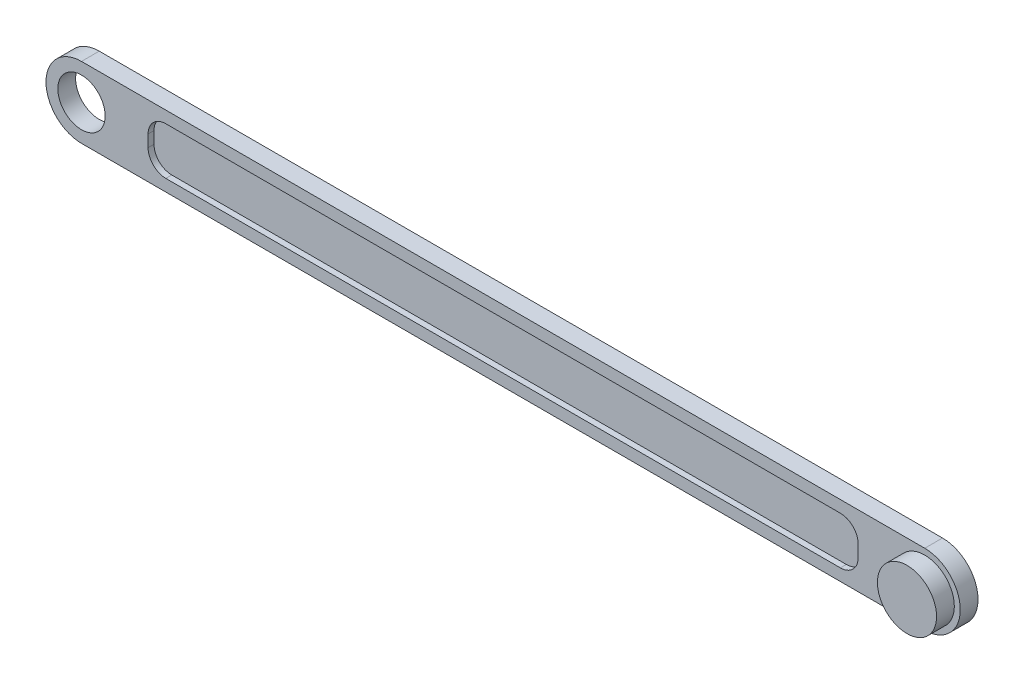
ISO-10303-21;
HEADER;
FILE_DESCRIPTION(('STEP AP214'),'2;1');
FILE_NAME('part.step','',(''),(''),'','','');
FILE_SCHEMA(('AUTOMOTIVE_DESIGN { 1 0 10303 214 1 1 1 1 }'));
ENDSEC;
DATA;
#1=APPLICATION_CONTEXT('core data for automotive mechanical design processes');
#2=APPLICATION_PROTOCOL_DEFINITION('international standard','automotive_design',2000,#1);
#3=PRODUCT_CONTEXT('',#1,'mechanical');
#4=PRODUCT('Part','Part','',(#3));
#5=PRODUCT_RELATED_PRODUCT_CATEGORY('part','',(#4));
#6=PRODUCT_DEFINITION_FORMATION('','',#4);
#7=PRODUCT_DEFINITION_CONTEXT('part definition',#1,'design');
#8=PRODUCT_DEFINITION('design','',#6,#7);
#9=PRODUCT_DEFINITION_SHAPE('','',#8);
#10=(LENGTH_UNIT() NAMED_UNIT(*) SI_UNIT(.MILLI.,.METRE.));
#11=(NAMED_UNIT(*) PLANE_ANGLE_UNIT() SI_UNIT($,.RADIAN.));
#12=(NAMED_UNIT(*) SI_UNIT($,.STERADIAN.) SOLID_ANGLE_UNIT());
#13=UNCERTAINTY_MEASURE_WITH_UNIT(LENGTH_MEASURE(1.E-05),#10,'distance_accuracy_value','');
#14=(GEOMETRIC_REPRESENTATION_CONTEXT(3) GLOBAL_UNCERTAINTY_ASSIGNED_CONTEXT((#13)) GLOBAL_UNIT_ASSIGNED_CONTEXT((#10,
#11,#12)) REPRESENTATION_CONTEXT('',''));
#15=CARTESIAN_POINT('',(0.,0.,0.));
#16=DIRECTION('',(0.,0.,1.));
#17=DIRECTION('',(1.,0.,0.));
#18=AXIS2_PLACEMENT_3D('',#15,#16,#17);
#19=CARTESIAN_POINT('',(0.,0.,3.));
#20=DIRECTION('',(0.,0.,1.));
#21=DIRECTION('',(1.,0.,0.));
#22=AXIS2_PLACEMENT_3D('',#19,#20,#21);
#23=PLANE('',#22);
#24=DIRECTION('',(0.,1.,0.));
#25=VECTOR('',#24,1.);
#26=CARTESIAN_POINT('',(131.25,-4.00000000000002,3.));
#27=LINE('',#26,#25);
#28=CARTESIAN_POINT('',(131.25,-1.00000000000001,3.));
#29=VERTEX_POINT('',#28);
#30=CARTESIAN_POINT('',(131.25,1.00000000000002,3.));
#31=VERTEX_POINT('',#30);
#32=EDGE_CURVE('E203',#29,#31,#27,.T.);
#33=ORIENTED_EDGE('',*,*,#32,.F.);
#34=CARTESIAN_POINT('',(128.25,-1.00000000000001,3.));
#35=DIRECTION('',(0.,0.,1.));
#36=DIRECTION('',(1.,0.,0.));
#37=AXIS2_PLACEMENT_3D('',#34,#35,#36);
#38=CIRCLE('',#37,3.);
#39=CARTESIAN_POINT('',(128.25,-4.00000000000002,3.));
#40=VERTEX_POINT('',#39);
#41=EDGE_CURVE('E189',#29,#40,#38,.F.);
#42=ORIENTED_EDGE('',*,*,#41,.T.);
#43=DIRECTION('',(1.,0.,0.));
#44=VECTOR('',#43,1.);
#45=CARTESIAN_POINT('',(11.25,-4.00000000000002,3.));
#46=LINE('',#45,#44);
#47=CARTESIAN_POINT('',(14.25,-4.00000000000002,3.));
#48=VERTEX_POINT('',#47);
#49=EDGE_CURVE('E229',#48,#40,#46,.T.);
#50=ORIENTED_EDGE('',*,*,#49,.F.);
#51=CARTESIAN_POINT('',(14.25,-1.00000000000002,3.));
#52=DIRECTION('',(0.,0.,1.));
#53=DIRECTION('',(1.,0.,0.));
#54=AXIS2_PLACEMENT_3D('',#51,#52,#53);
#55=CIRCLE('',#54,3.);
#56=CARTESIAN_POINT('',(11.25,-1.00000000000002,3.));
#57=VERTEX_POINT('',#56);
#58=EDGE_CURVE('E11',#48,#57,#55,.F.);
#59=ORIENTED_EDGE('',*,*,#58,.T.);
#60=DIRECTION('',(0.,-1.,0.));
#61=VECTOR('',#60,1.);
#62=CARTESIAN_POINT('',(11.25,-4.00000000000002,3.));
#63=LINE('',#62,#61);
#64=CARTESIAN_POINT('',(11.25,1.00000000000002,3.));
#65=VERTEX_POINT('',#64);
#66=EDGE_CURVE('E197',#65,#57,#63,.T.);
#67=ORIENTED_EDGE('',*,*,#66,.F.);
#68=CARTESIAN_POINT('',(14.25,1.00000000000002,3.));
#69=DIRECTION('',(0.,0.,1.));
#70=DIRECTION('',(1.,0.,0.));
#71=AXIS2_PLACEMENT_3D('',#68,#69,#70);
#72=CIRCLE('',#71,3.);
#73=CARTESIAN_POINT('',(14.25,4.00000000000002,3.));
#74=VERTEX_POINT('',#73);
#75=EDGE_CURVE('E53',#65,#74,#72,.F.);
#76=ORIENTED_EDGE('',*,*,#75,.T.);
#77=DIRECTION('',(-1.,0.,0.));
#78=VECTOR('',#77,1.);
#79=CARTESIAN_POINT('',(11.25,4.00000000000002,3.));
#80=LINE('',#79,#78);
#81=CARTESIAN_POINT('',(128.25,4.00000000000002,3.));
#82=VERTEX_POINT('',#81);
#83=EDGE_CURVE('E196',#82,#74,#80,.T.);
#84=ORIENTED_EDGE('',*,*,#83,.F.);
#85=CARTESIAN_POINT('',(128.25,1.00000000000002,3.));
#86=DIRECTION('',(0.,0.,1.));
#87=DIRECTION('',(1.,0.,0.));
#88=AXIS2_PLACEMENT_3D('',#85,#86,#87);
#89=CIRCLE('',#88,3.);
#90=EDGE_CURVE('E191',#82,#31,#89,.F.);
#91=ORIENTED_EDGE('',*,*,#90,.T.);
#92=EDGE_LOOP('',(#33,#42,#50,#59,#67,#76,#84,#91));
#93=FACE_BOUND('',#92,.T.);
#94=CARTESIAN_POINT('',(142.5,0.,3.));
#95=DIRECTION('',(0.,0.,1.));
#96=DIRECTION('',(1.,0.,0.));
#97=AXIS2_PLACEMENT_3D('',#94,#95,#96);
#98=CIRCLE('',#97,5.00000000000002);
#99=CARTESIAN_POINT('',(147.5,0.,3.));
#100=VERTEX_POINT('',#99);
#101=EDGE_CURVE('E220',#100,#100,#98,.T.);
#102=ORIENTED_EDGE('',*,*,#101,.F.);
#103=EDGE_LOOP('',(#102));
#104=FACE_BOUND('',#103,.T.);
#105=CARTESIAN_POINT('',(0.,0.,3.));
#106=DIRECTION('',(0.,0.,1.));
#107=DIRECTION('',(1.,0.,0.));
#108=AXIS2_PLACEMENT_3D('',#105,#106,#107);
#109=CIRCLE('',#108,4.);
#110=CARTESIAN_POINT('',(4.,0.,3.));
#111=VERTEX_POINT('',#110);
#112=EDGE_CURVE('E244',#111,#111,#109,.T.);
#113=ORIENTED_EDGE('',*,*,#112,.F.);
#114=EDGE_LOOP('',(#113));
#115=FACE_BOUND('',#114,.T.);
#116=CARTESIAN_POINT('',(0.,0.,3.));
#117=DIRECTION('',(0.,0.,1.));
#118=DIRECTION('',(1.,0.,0.));
#119=AXIS2_PLACEMENT_3D('',#116,#117,#118);
#120=CIRCLE('',#119,6.);
#121=CARTESIAN_POINT('',(0.,6.,3.));
#122=VERTEX_POINT('',#121);
#123=CARTESIAN_POINT('',(0.,-6.,3.));
#124=VERTEX_POINT('',#123);
#125=EDGE_CURVE('E144',#122,#124,#120,.T.);
#126=ORIENTED_EDGE('',*,*,#125,.T.);
#127=DIRECTION('',(1.,0.,0.));
#128=VECTOR('',#127,1.);
#129=CARTESIAN_POINT('',(0.,-6.,3.));
#130=LINE('',#129,#128);
#131=CARTESIAN_POINT('',(142.5,-6.,3.));
#132=VERTEX_POINT('',#131);
#133=EDGE_CURVE('E133',#124,#132,#130,.T.);
#134=ORIENTED_EDGE('',*,*,#133,.T.);
#135=CARTESIAN_POINT('',(142.5,0.,3.));
#136=DIRECTION('',(0.,0.,1.));
#137=DIRECTION('',(1.,0.,0.));
#138=AXIS2_PLACEMENT_3D('',#135,#136,#137);
#139=CIRCLE('',#138,6.);
#140=CARTESIAN_POINT('',(142.5,6.,3.));
#141=VERTEX_POINT('',#140);
#142=EDGE_CURVE('E143',#132,#141,#139,.T.);
#143=ORIENTED_EDGE('',*,*,#142,.T.);
#144=DIRECTION('',(-1.,0.,0.));
#145=VECTOR('',#144,1.);
#146=CARTESIAN_POINT('',(0.,6.,3.));
#147=LINE('',#146,#145);
#148=EDGE_CURVE('E148',#141,#122,#147,.T.);
#149=ORIENTED_EDGE('',*,*,#148,.T.);
#150=EDGE_LOOP('',(#126,#134,#143,#149));
#151=FACE_BOUND('',#150,.T.);
#152=ADVANCED_FACE('F45',(#93,#104,#115,#151),#23,.T.);
#153=CARTESIAN_POINT('',(0.,0.,0.));
#154=DIRECTION('',(0.,0.,1.));
#155=DIRECTION('',(1.,0.,0.));
#156=AXIS2_PLACEMENT_3D('',#153,#154,#155);
#157=PLANE('',#156);
#158=CARTESIAN_POINT('',(0.,0.,0.));
#159=DIRECTION('',(0.,0.,1.));
#160=DIRECTION('',(1.,0.,0.));
#161=AXIS2_PLACEMENT_3D('',#158,#159,#160);
#162=CIRCLE('',#161,6.);
#163=CARTESIAN_POINT('',(0.,6.,0.));
#164=VERTEX_POINT('',#163);
#165=CARTESIAN_POINT('',(0.,-6.,0.));
#166=VERTEX_POINT('',#165);
#167=EDGE_CURVE('E156',#164,#166,#162,.T.);
#168=ORIENTED_EDGE('',*,*,#167,.F.);
#169=DIRECTION('',(-1.,0.,0.));
#170=VECTOR('',#169,1.);
#171=CARTESIAN_POINT('',(0.,6.,0.));
#172=LINE('',#171,#170);
#173=CARTESIAN_POINT('',(142.5,6.,0.));
#174=VERTEX_POINT('',#173);
#175=EDGE_CURVE('E152',#174,#164,#172,.T.);
#176=ORIENTED_EDGE('',*,*,#175,.F.);
#177=CARTESIAN_POINT('',(142.5,0.,0.));
#178=DIRECTION('',(0.,0.,1.));
#179=DIRECTION('',(1.,0.,0.));
#180=AXIS2_PLACEMENT_3D('',#177,#178,#179);
#181=CIRCLE('',#180,6.);
#182=CARTESIAN_POINT('',(142.5,-6.,0.));
#183=VERTEX_POINT('',#182);
#184=EDGE_CURVE('E255',#183,#174,#181,.T.);
#185=ORIENTED_EDGE('',*,*,#184,.F.);
#186=DIRECTION('',(1.,0.,0.));
#187=VECTOR('',#186,1.);
#188=CARTESIAN_POINT('',(0.,-6.,0.));
#189=LINE('',#188,#187);
#190=EDGE_CURVE('E253',#166,#183,#189,.T.);
#191=ORIENTED_EDGE('',*,*,#190,.F.);
#192=EDGE_LOOP('',(#168,#176,#185,#191));
#193=FACE_BOUND('',#192,.T.);
#194=CARTESIAN_POINT('',(0.,0.,0.));
#195=DIRECTION('',(0.,0.,1.));
#196=DIRECTION('',(1.,0.,0.));
#197=AXIS2_PLACEMENT_3D('',#194,#195,#196);
#198=CIRCLE('',#197,4.);
#199=CARTESIAN_POINT('',(4.,0.,0.));
#200=VERTEX_POINT('',#199);
#201=EDGE_CURVE('E243',#200,#200,#198,.T.);
#202=ORIENTED_EDGE('',*,*,#201,.T.);
#203=EDGE_LOOP('',(#202));
#204=FACE_BOUND('',#203,.T.);
#205=CARTESIAN_POINT('',(142.5,0.,0.));
#206=DIRECTION('',(0.,0.,1.));
#207=DIRECTION('',(1.,0.,0.));
#208=AXIS2_PLACEMENT_3D('',#205,#206,#207);
#209=CIRCLE('',#208,3.99999999999999);
#210=CARTESIAN_POINT('',(146.5,0.,0.));
#211=VERTEX_POINT('',#210);
#212=EDGE_CURVE('E240',#211,#211,#209,.T.);
#213=ORIENTED_EDGE('',*,*,#212,.T.);
#214=EDGE_LOOP('',(#213));
#215=FACE_BOUND('',#214,.T.);
#216=ADVANCED_FACE('F266',(#193,#204,#215),#157,.F.);
#217=CARTESIAN_POINT('',(0.,0.,3.));
#218=DIRECTION('',(0.,0.,-1.));
#219=DIRECTION('',(-1.,0.,0.));
#220=AXIS2_PLACEMENT_3D('',#217,#218,#219);
#221=CYLINDRICAL_SURFACE('',#220,6.);
#222=ORIENTED_EDGE('',*,*,#167,.T.);
#223=DIRECTION('',(0.,0.,-1.));
#224=VECTOR('',#223,1.);
#225=CARTESIAN_POINT('',(0.,-6.,3.));
#226=LINE('',#225,#224);
#227=EDGE_CURVE('E137',#124,#166,#226,.T.);
#228=ORIENTED_EDGE('',*,*,#227,.F.);
#229=ORIENTED_EDGE('',*,*,#125,.F.);
#230=DIRECTION('',(0.,0.,-1.));
#231=VECTOR('',#230,1.);
#232=CARTESIAN_POINT('',(0.,6.,3.));
#233=LINE('',#232,#231);
#234=EDGE_CURVE('E251',#122,#164,#233,.T.);
#235=ORIENTED_EDGE('',*,*,#234,.T.);
#236=EDGE_LOOP('',(#222,#228,#229,#235));
#237=FACE_BOUND('',#236,.T.);
#238=ADVANCED_FACE('F154',(#237),#221,.T.);
#239=CARTESIAN_POINT('',(0.,-6.,3.));
#240=DIRECTION('',(0.,1.,0.));
#241=DIRECTION('',(0.,0.,1.));
#242=AXIS2_PLACEMENT_3D('',#239,#240,#241);
#243=PLANE('',#242);
#244=ORIENTED_EDGE('',*,*,#190,.T.);
#245=DIRECTION('',(0.,0.,-1.));
#246=VECTOR('',#245,1.);
#247=CARTESIAN_POINT('',(142.5,-6.,3.));
#248=LINE('',#247,#246);
#249=EDGE_CURVE('E140',#132,#183,#248,.T.);
#250=ORIENTED_EDGE('',*,*,#249,.F.);
#251=ORIENTED_EDGE('',*,*,#133,.F.);
#252=ORIENTED_EDGE('',*,*,#227,.T.);
#253=EDGE_LOOP('',(#244,#250,#251,#252));
#254=FACE_BOUND('',#253,.T.);
#255=ADVANCED_FACE('F135',(#254),#243,.F.);
#256=CARTESIAN_POINT('',(142.5,0.,3.));
#257=DIRECTION('',(0.,0.,-1.));
#258=DIRECTION('',(-1.,0.,0.));
#259=AXIS2_PLACEMENT_3D('',#256,#257,#258);
#260=CYLINDRICAL_SURFACE('',#259,6.);
#261=ORIENTED_EDGE('',*,*,#184,.T.);
#262=DIRECTION('',(0.,0.,-1.));
#263=VECTOR('',#262,1.);
#264=CARTESIAN_POINT('',(142.5,6.,3.));
#265=LINE('',#264,#263);
#266=EDGE_CURVE('E161',#141,#174,#265,.T.);
#267=ORIENTED_EDGE('',*,*,#266,.F.);
#268=ORIENTED_EDGE('',*,*,#142,.F.);
#269=ORIENTED_EDGE('',*,*,#249,.T.);
#270=EDGE_LOOP('',(#261,#267,#268,#269));
#271=FACE_BOUND('',#270,.T.);
#272=ADVANCED_FACE('F268',(#271),#260,.T.);
#273=CARTESIAN_POINT('',(0.,6.,3.));
#274=DIRECTION('',(0.,-1.,0.));
#275=DIRECTION('',(0.,0.,-1.));
#276=AXIS2_PLACEMENT_3D('',#273,#274,#275);
#277=PLANE('',#276);
#278=ORIENTED_EDGE('',*,*,#175,.T.);
#279=ORIENTED_EDGE('',*,*,#234,.F.);
#280=ORIENTED_EDGE('',*,*,#148,.F.);
#281=ORIENTED_EDGE('',*,*,#266,.T.);
#282=EDGE_LOOP('',(#278,#279,#280,#281));
#283=FACE_BOUND('',#282,.T.);
#284=ADVANCED_FACE('F262',(#283),#277,.F.);
#285=CARTESIAN_POINT('',(0.,0.,3.));
#286=DIRECTION('',(0.,0.,-1.));
#287=DIRECTION('',(-1.,0.,0.));
#288=AXIS2_PLACEMENT_3D('',#285,#286,#287);
#289=CYLINDRICAL_SURFACE('',#288,4.);
#290=ORIENTED_EDGE('',*,*,#112,.T.);
#291=EDGE_LOOP('',(#290));
#292=FACE_BOUND('',#291,.T.);
#293=ORIENTED_EDGE('',*,*,#201,.F.);
#294=EDGE_LOOP('',(#293));
#295=FACE_BOUND('',#294,.T.);
#296=ADVANCED_FACE('F275',(#292,#295),#289,.F.);
#297=CARTESIAN_POINT('',(142.5,0.,3.));
#298=DIRECTION('',(0.,0.,-1.));
#299=DIRECTION('',(-1.,0.,0.));
#300=AXIS2_PLACEMENT_3D('',#297,#298,#299);
#301=CYLINDRICAL_SURFACE('',#300,3.99999999999999);
#302=CARTESIAN_POINT('',(142.5,0.,3.));
#303=DIRECTION('',(0.,0.,1.));
#304=DIRECTION('',(1.,0.,0.));
#305=AXIS2_PLACEMENT_3D('',#302,#303,#304);
#306=CIRCLE('',#305,3.99999999999999);
#307=CARTESIAN_POINT('',(146.5,0.,3.));
#308=VERTEX_POINT('',#307);
#309=EDGE_CURVE('E235',#308,#308,#306,.T.);
#310=ORIENTED_EDGE('',*,*,#309,.T.);
#311=EDGE_LOOP('',(#310));
#312=FACE_BOUND('',#311,.T.);
#313=ORIENTED_EDGE('',*,*,#212,.F.);
#314=EDGE_LOOP('',(#313));
#315=FACE_BOUND('',#314,.T.);
#316=ADVANCED_FACE('F289',(#312,#315),#301,.F.);
#317=CARTESIAN_POINT('',(142.5,0.,3.));
#318=DIRECTION('',(0.,0.,1.));
#319=DIRECTION('',(1.,0.,0.));
#320=AXIS2_PLACEMENT_3D('',#317,#318,#319);
#321=PLANE('',#320);
#322=ORIENTED_EDGE('',*,*,#309,.F.);
#323=EDGE_LOOP('',(#322));
#324=FACE_BOUND('',#323,.T.);
#325=ADVANCED_FACE('F293',(#324),#321,.F.);
#326=CARTESIAN_POINT('',(142.5,0.,6.));
#327=DIRECTION('',(0.,0.,-1.));
#328=DIRECTION('',(-1.,0.,0.));
#329=AXIS2_PLACEMENT_3D('',#326,#327,#328);
#330=CYLINDRICAL_SURFACE('',#329,5.00000000000002);
#331=CARTESIAN_POINT('',(142.5,0.,6.));
#332=DIRECTION('',(0.,0.,1.));
#333=DIRECTION('',(1.,0.,0.));
#334=AXIS2_PLACEMENT_3D('',#331,#332,#333);
#335=CIRCLE('',#334,5.00000000000002);
#336=CARTESIAN_POINT('',(147.5,0.,6.));
#337=VERTEX_POINT('',#336);
#338=EDGE_CURVE('E232',#337,#337,#335,.T.);
#339=ORIENTED_EDGE('',*,*,#338,.F.);
#340=EDGE_LOOP('',(#339));
#341=FACE_BOUND('',#340,.T.);
#342=ORIENTED_EDGE('',*,*,#101,.T.);
#343=EDGE_LOOP('',(#342));
#344=FACE_BOUND('',#343,.T.);
#345=ADVANCED_FACE('F295',(#341,#344),#330,.T.);
#346=CARTESIAN_POINT('',(142.5,0.,6.));
#347=DIRECTION('',(0.,0.,1.));
#348=DIRECTION('',(1.,0.,0.));
#349=AXIS2_PLACEMENT_3D('',#346,#347,#348);
#350=PLANE('',#349);
#351=ORIENTED_EDGE('',*,*,#338,.T.);
#352=EDGE_LOOP('',(#351));
#353=FACE_BOUND('',#352,.T.);
#354=ADVANCED_FACE('F298',(#353),#350,.T.);
#355=CARTESIAN_POINT('',(131.25,-4.00000000000002,2.));
#356=DIRECTION('',(1.,0.,0.));
#357=DIRECTION('',(0.,0.,-1.));
#358=AXIS2_PLACEMENT_3D('',#355,#356,#357);
#359=PLANE('',#358);
#360=DIRECTION('',(0.,1.,0.));
#361=VECTOR('',#360,1.);
#362=CARTESIAN_POINT('',(131.25,-4.00000000000002,2.));
#363=LINE('',#362,#361);
#364=CARTESIAN_POINT('',(131.25,-1.00000000000001,2.));
#365=VERTEX_POINT('',#364);
#366=CARTESIAN_POINT('',(131.25,1.00000000000002,2.));
#367=VERTEX_POINT('',#366);
#368=EDGE_CURVE('E222',#365,#367,#363,.T.);
#369=ORIENTED_EDGE('',*,*,#368,.F.);
#370=DIRECTION('',(0.,0.,1.));
#371=VECTOR('',#370,1.);
#372=CARTESIAN_POINT('',(131.25,-1.00000000000001,3.));
#373=LINE('',#372,#371);
#374=EDGE_CURVE('E159',#365,#29,#373,.T.);
#375=ORIENTED_EDGE('',*,*,#374,.T.);
#376=ORIENTED_EDGE('',*,*,#32,.T.);
#377=DIRECTION('',(0.,0.,1.));
#378=VECTOR('',#377,1.);
#379=CARTESIAN_POINT('',(131.25,1.00000000000002,2.));
#380=LINE('',#379,#378);
#381=EDGE_CURVE('E157',#31,#367,#380,.F.);
#382=ORIENTED_EDGE('',*,*,#381,.T.);
#383=EDGE_LOOP('',(#369,#375,#376,#382));
#384=FACE_BOUND('',#383,.T.);
#385=ADVANCED_FACE('F304',(#384),#359,.F.);
#386=CARTESIAN_POINT('',(11.25,-4.00000000000002,2.));
#387=DIRECTION('',(0.,-1.,0.));
#388=DIRECTION('',(1.,0.,0.));
#389=AXIS2_PLACEMENT_3D('',#386,#387,#388);
#390=PLANE('',#389);
#391=ORIENTED_EDGE('',*,*,#49,.T.);
#392=DIRECTION('',(0.,0.,1.));
#393=VECTOR('',#392,1.);
#394=CARTESIAN_POINT('',(128.25,-4.00000000000002,2.));
#395=LINE('',#394,#393);
#396=CARTESIAN_POINT('',(128.25,-4.00000000000002,2.));
#397=VERTEX_POINT('',#396);
#398=EDGE_CURVE('E170',#40,#397,#395,.F.);
#399=ORIENTED_EDGE('',*,*,#398,.T.);
#400=DIRECTION('',(1.,0.,0.));
#401=VECTOR('',#400,1.);
#402=CARTESIAN_POINT('',(11.25,-4.00000000000002,2.));
#403=LINE('',#402,#401);
#404=CARTESIAN_POINT('',(14.25,-4.00000000000002,2.));
#405=VERTEX_POINT('',#404);
#406=EDGE_CURVE('E218',#405,#397,#403,.T.);
#407=ORIENTED_EDGE('',*,*,#406,.F.);
#408=DIRECTION('',(0.,0.,1.));
#409=VECTOR('',#408,1.);
#410=CARTESIAN_POINT('',(14.25,-4.00000000000002,3.));
#411=LINE('',#410,#409);
#412=EDGE_CURVE('E167',#405,#48,#411,.T.);
#413=ORIENTED_EDGE('',*,*,#412,.T.);
#414=EDGE_LOOP('',(#391,#399,#407,#413));
#415=FACE_BOUND('',#414,.T.);
#416=ADVANCED_FACE('F308',(#415),#390,.F.);
#417=CARTESIAN_POINT('',(11.25,-4.00000000000002,2.));
#418=DIRECTION('',(-1.,0.,0.));
#419=DIRECTION('',(0.,0.,1.));
#420=AXIS2_PLACEMENT_3D('',#417,#418,#419);
#421=PLANE('',#420);
#422=DIRECTION('',(0.,-1.,0.));
#423=VECTOR('',#422,1.);
#424=CARTESIAN_POINT('',(11.25,-4.00000000000002,2.));
#425=LINE('',#424,#423);
#426=CARTESIAN_POINT('',(11.25,1.00000000000002,2.));
#427=VERTEX_POINT('',#426);
#428=CARTESIAN_POINT('',(11.25,-1.00000000000002,2.));
#429=VERTEX_POINT('',#428);
#430=EDGE_CURVE('E212',#427,#429,#425,.T.);
#431=ORIENTED_EDGE('',*,*,#430,.F.);
#432=DIRECTION('',(0.,0.,1.));
#433=VECTOR('',#432,1.);
#434=CARTESIAN_POINT('',(11.25,1.00000000000002,3.));
#435=LINE('',#434,#433);
#436=EDGE_CURVE('E187',#427,#65,#435,.T.);
#437=ORIENTED_EDGE('',*,*,#436,.T.);
#438=ORIENTED_EDGE('',*,*,#66,.T.);
#439=DIRECTION('',(0.,0.,1.));
#440=VECTOR('',#439,1.);
#441=CARTESIAN_POINT('',(11.25,-1.00000000000002,2.));
#442=LINE('',#441,#440);
#443=EDGE_CURVE('E185',#57,#429,#442,.F.);
#444=ORIENTED_EDGE('',*,*,#443,.T.);
#445=EDGE_LOOP('',(#431,#437,#438,#444));
#446=FACE_BOUND('',#445,.T.);
#447=ADVANCED_FACE('F216',(#446),#421,.F.);
#448=CARTESIAN_POINT('',(11.25,4.00000000000002,2.));
#449=DIRECTION('',(0.,1.,0.));
#450=DIRECTION('',(0.,0.,1.));
#451=AXIS2_PLACEMENT_3D('',#448,#449,#450);
#452=PLANE('',#451);
#453=DIRECTION('',(-1.,0.,0.));
#454=VECTOR('',#453,1.);
#455=CARTESIAN_POINT('',(11.25,4.00000000000002,2.));
#456=LINE('',#455,#454);
#457=CARTESIAN_POINT('',(128.25,4.00000000000002,2.));
#458=VERTEX_POINT('',#457);
#459=CARTESIAN_POINT('',(14.25,4.00000000000002,2.));
#460=VERTEX_POINT('',#459);
#461=EDGE_CURVE('E214',#458,#460,#456,.T.);
#462=ORIENTED_EDGE('',*,*,#461,.F.);
#463=DIRECTION('',(0.,0.,1.));
#464=VECTOR('',#463,1.);
#465=CARTESIAN_POINT('',(128.25,4.00000000000002,3.));
#466=LINE('',#465,#464);
#467=EDGE_CURVE('E182',#458,#82,#466,.T.);
#468=ORIENTED_EDGE('',*,*,#467,.T.);
#469=ORIENTED_EDGE('',*,*,#83,.T.);
#470=DIRECTION('',(0.,0.,1.));
#471=VECTOR('',#470,1.);
#472=CARTESIAN_POINT('',(14.25,4.00000000000002,2.));
#473=LINE('',#472,#471);
#474=EDGE_CURVE('E180',#74,#460,#473,.F.);
#475=ORIENTED_EDGE('',*,*,#474,.T.);
#476=EDGE_LOOP('',(#462,#468,#469,#475));
#477=FACE_BOUND('',#476,.T.);
#478=ADVANCED_FACE('F200',(#477),#452,.F.);
#479=CARTESIAN_POINT('',(0.,0.,2.));
#480=DIRECTION('',(0.,0.,-1.));
#481=DIRECTION('',(-1.,0.,0.));
#482=AXIS2_PLACEMENT_3D('',#479,#480,#481);
#483=PLANE('',#482);
#484=ORIENTED_EDGE('',*,*,#406,.T.);
#485=CARTESIAN_POINT('',(128.25,-1.00000000000001,2.));
#486=DIRECTION('',(0.,0.,-1.));
#487=DIRECTION('',(-1.,0.,0.));
#488=AXIS2_PLACEMENT_3D('',#485,#486,#487);
#489=CIRCLE('',#488,3.);
#490=EDGE_CURVE('E178',#397,#365,#489,.F.);
#491=ORIENTED_EDGE('',*,*,#490,.T.);
#492=ORIENTED_EDGE('',*,*,#368,.T.);
#493=CARTESIAN_POINT('',(128.25,1.00000000000002,2.));
#494=DIRECTION('',(0.,0.,-1.));
#495=DIRECTION('',(-1.,0.,0.));
#496=AXIS2_PLACEMENT_3D('',#493,#494,#495);
#497=CIRCLE('',#496,3.);
#498=EDGE_CURVE('E176',#367,#458,#497,.F.);
#499=ORIENTED_EDGE('',*,*,#498,.T.);
#500=ORIENTED_EDGE('',*,*,#461,.T.);
#501=CARTESIAN_POINT('',(14.25,1.00000000000002,2.));
#502=DIRECTION('',(0.,0.,-1.));
#503=DIRECTION('',(-1.,0.,0.));
#504=AXIS2_PLACEMENT_3D('',#501,#502,#503);
#505=CIRCLE('',#504,3.);
#506=EDGE_CURVE('E174',#460,#427,#505,.F.);
#507=ORIENTED_EDGE('',*,*,#506,.T.);
#508=ORIENTED_EDGE('',*,*,#430,.T.);
#509=CARTESIAN_POINT('',(14.25,-1.00000000000002,2.));
#510=DIRECTION('',(0.,0.,-1.));
#511=DIRECTION('',(-1.,0.,0.));
#512=AXIS2_PLACEMENT_3D('',#509,#510,#511);
#513=CIRCLE('',#512,3.);
#514=EDGE_CURVE('E172',#429,#405,#513,.F.);
#515=ORIENTED_EDGE('',*,*,#514,.T.);
#516=EDGE_LOOP('',(#484,#491,#492,#499,#500,#507,#508,#515));
#517=FACE_BOUND('',#516,.T.);
#518=ADVANCED_FACE('F211',(#517),#483,.F.);
#519=CARTESIAN_POINT('',(128.25,-1.00000000000001,2.));
#520=DIRECTION('',(0.,0.,-1.));
#521=DIRECTION('',(-1.,0.,0.));
#522=AXIS2_PLACEMENT_3D('',#519,#520,#521);
#523=CYLINDRICAL_SURFACE('',#522,3.);
#524=ORIENTED_EDGE('',*,*,#490,.F.);
#525=ORIENTED_EDGE('',*,*,#398,.F.);
#526=ORIENTED_EDGE('',*,*,#41,.F.);
#527=ORIENTED_EDGE('',*,*,#374,.F.);
#528=EDGE_LOOP('',(#524,#525,#526,#527));
#529=FACE_BOUND('',#528,.T.);
#530=ADVANCED_FACE('F318',(#529),#523,.F.);
#531=CARTESIAN_POINT('',(128.25,1.00000000000002,2.));
#532=DIRECTION('',(0.,0.,-1.));
#533=DIRECTION('',(-1.,0.,0.));
#534=AXIS2_PLACEMENT_3D('',#531,#532,#533);
#535=CYLINDRICAL_SURFACE('',#534,3.);
#536=ORIENTED_EDGE('',*,*,#498,.F.);
#537=ORIENTED_EDGE('',*,*,#381,.F.);
#538=ORIENTED_EDGE('',*,*,#90,.F.);
#539=ORIENTED_EDGE('',*,*,#467,.F.);
#540=EDGE_LOOP('',(#536,#537,#538,#539));
#541=FACE_BOUND('',#540,.T.);
#542=ADVANCED_FACE('F322',(#541),#535,.F.);
#543=CARTESIAN_POINT('',(14.25,1.00000000000002,2.));
#544=DIRECTION('',(0.,0.,-1.));
#545=DIRECTION('',(-1.,0.,0.));
#546=AXIS2_PLACEMENT_3D('',#543,#544,#545);
#547=CYLINDRICAL_SURFACE('',#546,3.);
#548=ORIENTED_EDGE('',*,*,#506,.F.);
#549=ORIENTED_EDGE('',*,*,#474,.F.);
#550=ORIENTED_EDGE('',*,*,#75,.F.);
#551=ORIENTED_EDGE('',*,*,#436,.F.);
#552=EDGE_LOOP('',(#548,#549,#550,#551));
#553=FACE_BOUND('',#552,.T.);
#554=ADVANCED_FACE('F206',(#553),#547,.F.);
#555=CARTESIAN_POINT('',(14.25,-1.00000000000002,2.));
#556=DIRECTION('',(0.,0.,-1.));
#557=DIRECTION('',(-1.,0.,0.));
#558=AXIS2_PLACEMENT_3D('',#555,#556,#557);
#559=CYLINDRICAL_SURFACE('',#558,3.);
#560=ORIENTED_EDGE('',*,*,#514,.F.);
#561=ORIENTED_EDGE('',*,*,#443,.F.);
#562=ORIENTED_EDGE('',*,*,#58,.F.);
#563=ORIENTED_EDGE('',*,*,#412,.F.);
#564=EDGE_LOOP('',(#560,#561,#562,#563));
#565=FACE_BOUND('',#564,.T.);
#566=ADVANCED_FACE('F47',(#565),#559,.F.);
#567=CLOSED_SHELL('',(#152,#216,#238,#255,#272,#284,#296,#316,#325,#345,#354,#385,#416,#447,
#478,#518,#530,#542,#554,#566));
#568=MANIFOLD_SOLID_BREP('B2',#567);
#569=ADVANCED_BREP_SHAPE_REPRESENTATION('',(#18,#568),#14);
#570=SHAPE_DEFINITION_REPRESENTATION(#9,#569);
ENDSEC;
END-ISO-10303-21;
